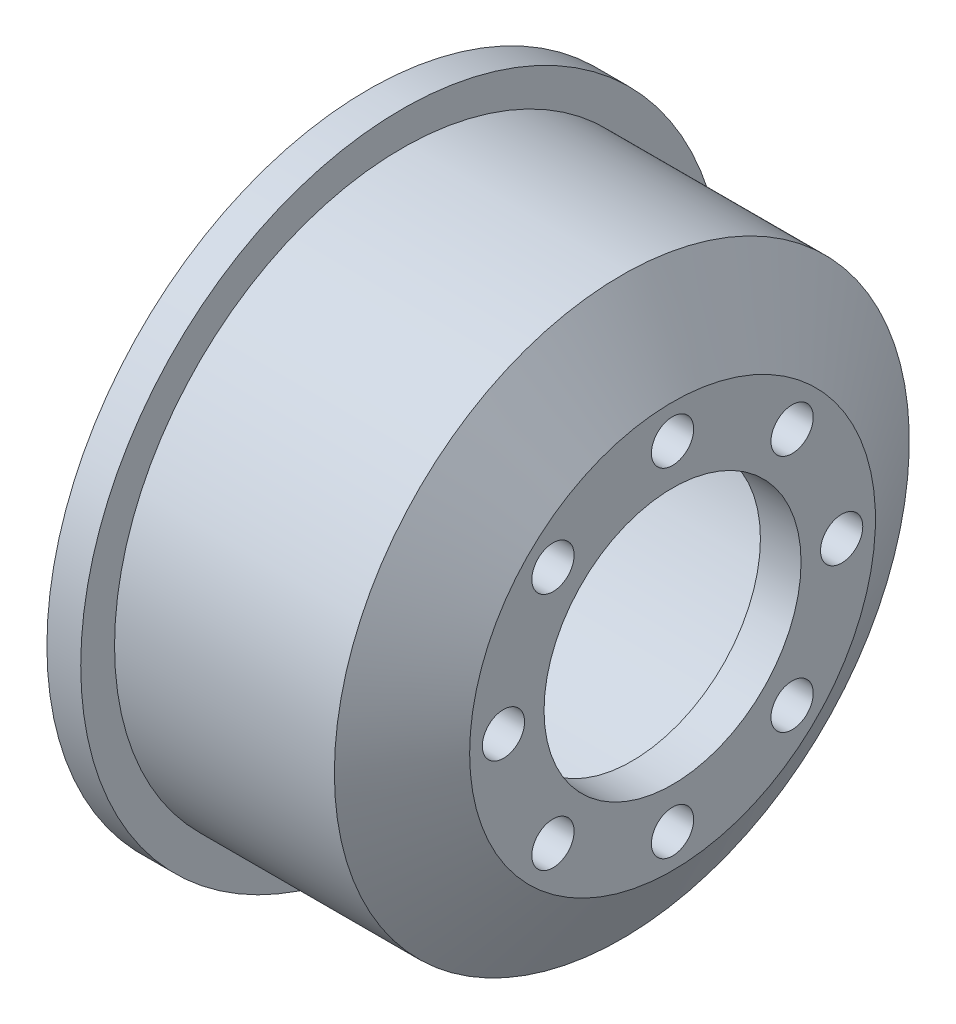
ISO-10303-21;
HEADER;
FILE_DESCRIPTION(('STEP AP214'),'2;1');
FILE_NAME('part.step','',(''),(''),'','','');
FILE_SCHEMA(('AUTOMOTIVE_DESIGN { 1 0 10303 214 1 1 1 1 }'));
ENDSEC;
DATA;
#1=APPLICATION_CONTEXT('core data for automotive mechanical design processes');
#2=APPLICATION_PROTOCOL_DEFINITION('international standard','automotive_design',2000,#1);
#3=PRODUCT_CONTEXT('',#1,'mechanical');
#4=PRODUCT('Part','Part','',(#3));
#5=PRODUCT_RELATED_PRODUCT_CATEGORY('part','',(#4));
#6=PRODUCT_DEFINITION_FORMATION('','',#4);
#7=PRODUCT_DEFINITION_CONTEXT('part definition',#1,'design');
#8=PRODUCT_DEFINITION('design','',#6,#7);
#9=PRODUCT_DEFINITION_SHAPE('','',#8);
#10=(LENGTH_UNIT() NAMED_UNIT(*) SI_UNIT(.MILLI.,.METRE.));
#11=(NAMED_UNIT(*) PLANE_ANGLE_UNIT() SI_UNIT($,.RADIAN.));
#12=(NAMED_UNIT(*) SI_UNIT($,.STERADIAN.) SOLID_ANGLE_UNIT());
#13=UNCERTAINTY_MEASURE_WITH_UNIT(LENGTH_MEASURE(1.E-05),#10,'distance_accuracy_value','');
#14=(GEOMETRIC_REPRESENTATION_CONTEXT(3) GLOBAL_UNCERTAINTY_ASSIGNED_CONTEXT((#13)) GLOBAL_UNIT_ASSIGNED_CONTEXT((#10,
#11,#12)) REPRESENTATION_CONTEXT('',''));
#15=CARTESIAN_POINT('',(0.,0.,0.));
#16=DIRECTION('',(0.,0.,1.));
#17=DIRECTION('',(1.,0.,0.));
#18=AXIS2_PLACEMENT_3D('',#15,#16,#17);
#19=CARTESIAN_POINT('',(-37.2788661687838,0.,0.));
#20=DIRECTION('',(-1.,0.,0.));
#21=DIRECTION('',(0.,0.,1.));
#22=AXIS2_PLACEMENT_3D('',#19,#20,#21);
#23=CYLINDRICAL_SURFACE('',#22,7.6);
#24=CARTESIAN_POINT('',(10.1398131593203,0.,0.));
#25=DIRECTION('',(-1.,0.,0.));
#26=DIRECTION('',(0.,0.,1.));
#27=AXIS2_PLACEMENT_3D('',#24,#25,#26);
#28=CIRCLE('',#27,7.6);
#29=CARTESIAN_POINT('',(10.1398131593203,0.,7.6));
#30=VERTEX_POINT('',#29);
#31=EDGE_CURVE('E10',#30,#30,#28,.T.);
#32=ORIENTED_EDGE('',*,*,#31,.F.);
#33=EDGE_LOOP('',(#32));
#34=FACE_BOUND('',#33,.T.);
#35=CARTESIAN_POINT('',(7.73636722696176,0.,0.));
#36=DIRECTION('',(-1.,0.,0.));
#37=DIRECTION('',(0.,0.,1.));
#38=AXIS2_PLACEMENT_3D('',#35,#36,#37);
#39=CIRCLE('',#38,7.6);
#40=CARTESIAN_POINT('',(7.73636722696176,0.,7.6));
#41=VERTEX_POINT('',#40);
#42=EDGE_CURVE('E76',#41,#41,#39,.T.);
#43=ORIENTED_EDGE('',*,*,#42,.T.);
#44=EDGE_LOOP('',(#43));
#45=FACE_BOUND('',#44,.T.);
#46=ADVANCED_FACE('F37',(#34,#45),#23,.F.);
#47=CARTESIAN_POINT('',(10.1398131593203,0.,-7.6));
#48=DIRECTION('',(-1.,0.,0.));
#49=DIRECTION('',(0.,0.,1.));
#50=AXIS2_PLACEMENT_3D('',#47,#48,#49);
#51=PLANE('',#50);
#52=CARTESIAN_POINT('',(10.1398131593203,10.,0.));
#53=DIRECTION('',(1.,0.,0.));
#54=DIRECTION('',(0.,0.,-1.));
#55=AXIS2_PLACEMENT_3D('',#52,#53,#54);
#56=CIRCLE('',#55,1.25);
#57=CARTESIAN_POINT('',(10.1398131593203,10.,-1.25));
#58=VERTEX_POINT('',#57);
#59=EDGE_CURVE('E57',#58,#58,#56,.T.);
#60=ORIENTED_EDGE('',*,*,#59,.F.);
#61=EDGE_LOOP('',(#60));
#62=FACE_BOUND('',#61,.T.);
#63=CARTESIAN_POINT('',(10.1398131593203,7.07106781186578,-7.0710678118656));
#64=DIRECTION('',(1.,0.,0.));
#65=DIRECTION('',(0.,0.,-1.));
#66=AXIS2_PLACEMENT_3D('',#63,#64,#65);
#67=CIRCLE('',#66,1.25000000000005);
#68=CARTESIAN_POINT('',(10.1398131593203,7.07106781186578,-8.32106781186565));
#69=VERTEX_POINT('',#68);
#70=EDGE_CURVE('E200',#69,#69,#67,.T.);
#71=ORIENTED_EDGE('',*,*,#70,.F.);
#72=EDGE_LOOP('',(#71));
#73=FACE_BOUND('',#72,.T.);
#74=CARTESIAN_POINT('',(10.1398131593203,4.24488671257339E-13,-10.0000000000004));
#75=DIRECTION('',(1.,0.,0.));
#76=DIRECTION('',(0.,0.,-1.));
#77=AXIS2_PLACEMENT_3D('',#74,#75,#76);
#78=CIRCLE('',#77,1.25000000000032);
#79=CARTESIAN_POINT('',(10.1398131593203,4.24488671257339E-13,-11.2500000000007));
#80=VERTEX_POINT('',#79);
#81=EDGE_CURVE('E203',#80,#80,#78,.T.);
#82=ORIENTED_EDGE('',*,*,#81,.F.);
#83=EDGE_LOOP('',(#82));
#84=FACE_BOUND('',#83,.T.);
#85=CARTESIAN_POINT('',(10.1398131593203,-7.07106781186517,-7.0710678118662));
#86=DIRECTION('',(1.,0.,0.));
#87=DIRECTION('',(0.,0.,-1.));
#88=AXIS2_PLACEMENT_3D('',#85,#86,#87);
#89=CIRCLE('',#88,1.25000000000066);
#90=CARTESIAN_POINT('',(10.1398131593203,-7.07106781186517,-8.32106781186686));
#91=VERTEX_POINT('',#90);
#92=EDGE_CURVE('E208',#91,#91,#89,.T.);
#93=ORIENTED_EDGE('',*,*,#92,.F.);
#94=EDGE_LOOP('',(#93));
#95=FACE_BOUND('',#94,.T.);
#96=CARTESIAN_POINT('',(10.1398131593203,-10.,-8.48977342514678E-13));
#97=DIRECTION('',(1.,0.,0.));
#98=DIRECTION('',(0.,0.,-1.));
#99=AXIS2_PLACEMENT_3D('',#96,#97,#98);
#100=CIRCLE('',#99,1.25000000000088);
#101=CARTESIAN_POINT('',(10.1398131593203,-10.,-1.25000000000173));
#102=VERTEX_POINT('',#101);
#103=EDGE_CURVE('E211',#102,#102,#100,.T.);
#104=ORIENTED_EDGE('',*,*,#103,.F.);
#105=EDGE_LOOP('',(#104));
#106=FACE_BOUND('',#105,.T.);
#107=CARTESIAN_POINT('',(10.1398131593203,-7.07106781186578,7.07106781186475));
#108=DIRECTION('',(1.,0.,0.));
#109=DIRECTION('',(0.,0.,-1.));
#110=AXIS2_PLACEMENT_3D('',#107,#108,#109);
#111=CIRCLE('',#110,1.25000000000086);
#112=CARTESIAN_POINT('',(10.1398131593203,-7.07106781186578,5.82106781186389));
#113=VERTEX_POINT('',#112);
#114=EDGE_CURVE('E214',#113,#113,#111,.T.);
#115=ORIENTED_EDGE('',*,*,#114,.F.);
#116=EDGE_LOOP('',(#115));
#117=FACE_BOUND('',#116,.T.);
#118=CARTESIAN_POINT('',(10.1398131593203,-4.25713318056486E-13,9.99999999999958));
#119=DIRECTION('',(1.,0.,0.));
#120=DIRECTION('',(0.,0.,-1.));
#121=AXIS2_PLACEMENT_3D('',#118,#119,#120);
#122=CIRCLE('',#121,1.25000000000063);
#123=CARTESIAN_POINT('',(10.1398131593203,-4.25713318056486E-13,8.74999999999895));
#124=VERTEX_POINT('',#123);
#125=EDGE_CURVE('E216',#124,#124,#122,.T.);
#126=ORIENTED_EDGE('',*,*,#125,.F.);
#127=EDGE_LOOP('',(#126));
#128=FACE_BOUND('',#127,.T.);
#129=CARTESIAN_POINT('',(10.1398131593203,7.07106781186517,7.07106781186535));
#130=DIRECTION('',(1.,0.,0.));
#131=DIRECTION('',(0.,0.,-1.));
#132=AXIS2_PLACEMENT_3D('',#129,#130,#131);
#133=CIRCLE('',#132,1.25000000000032);
#134=CARTESIAN_POINT('',(10.1398131593203,7.07106781186517,5.82106781186503));
#135=VERTEX_POINT('',#134);
#136=EDGE_CURVE('E88',#135,#135,#133,.T.);
#137=ORIENTED_EDGE('',*,*,#136,.F.);
#138=EDGE_LOOP('',(#137));
#139=FACE_BOUND('',#138,.T.);
#140=CARTESIAN_POINT('',(10.1398131593203,0.,0.));
#141=DIRECTION('',(-1.,0.,0.));
#142=DIRECTION('',(0.,0.,1.));
#143=AXIS2_PLACEMENT_3D('',#140,#141,#142);
#144=CIRCLE('',#143,12.);
#145=CARTESIAN_POINT('',(10.1398131593203,0.,12.));
#146=VERTEX_POINT('',#145);
#147=EDGE_CURVE('E44',#146,#146,#144,.T.);
#148=ORIENTED_EDGE('',*,*,#147,.F.);
#149=EDGE_LOOP('',(#148));
#150=FACE_BOUND('',#149,.T.);
#151=ORIENTED_EDGE('',*,*,#31,.T.);
#152=EDGE_LOOP('',(#151));
#153=FACE_BOUND('',#152,.T.);
#154=ADVANCED_FACE('F118',(#62,#73,#84,#95,#106,#117,#128,#139,#150,#153),#51,.F.);
#155=CARTESIAN_POINT('',(10.1398131593203,0.,0.));
#156=DIRECTION('',(-1.,0.,0.));
#157=DIRECTION('',(0.,0.,1.));
#158=AXIS2_PLACEMENT_3D('',#155,#156,#157);
#159=CONICAL_SURFACE('',#158,12.,1.03037682652431);
#160=CARTESIAN_POINT('',(7.13981315932029,0.,0.));
#161=DIRECTION('',(-1.,0.,0.));
#162=DIRECTION('',(0.,0.,1.));
#163=AXIS2_PLACEMENT_3D('',#160,#161,#162);
#164=CIRCLE('',#163,17.);
#165=CARTESIAN_POINT('',(7.13981315932029,0.,17.));
#166=VERTEX_POINT('',#165);
#167=EDGE_CURVE('E49',#166,#166,#164,.T.);
#168=ORIENTED_EDGE('',*,*,#167,.F.);
#169=EDGE_LOOP('',(#168));
#170=FACE_BOUND('',#169,.T.);
#171=ORIENTED_EDGE('',*,*,#147,.T.);
#172=EDGE_LOOP('',(#171));
#173=FACE_BOUND('',#172,.T.);
#174=ADVANCED_FACE('F115',(#170,#173),#159,.T.);
#175=CARTESIAN_POINT('',(-37.2788661687838,0.,0.));
#176=DIRECTION('',(-1.,0.,0.));
#177=DIRECTION('',(0.,0.,1.));
#178=AXIS2_PLACEMENT_3D('',#175,#176,#177);
#179=CYLINDRICAL_SURFACE('',#178,17.);
#180=CARTESIAN_POINT('',(-5.86018684067971,0.,0.));
#181=DIRECTION('',(-1.,0.,0.));
#182=DIRECTION('',(0.,0.,1.));
#183=AXIS2_PLACEMENT_3D('',#180,#181,#182);
#184=CIRCLE('',#183,17.);
#185=CARTESIAN_POINT('',(-5.86018684067971,0.,17.));
#186=VERTEX_POINT('',#185);
#187=EDGE_CURVE('E108',#186,#186,#184,.T.);
#188=ORIENTED_EDGE('',*,*,#187,.F.);
#189=EDGE_LOOP('',(#188));
#190=FACE_BOUND('',#189,.T.);
#191=ORIENTED_EDGE('',*,*,#167,.T.);
#192=EDGE_LOOP('',(#191));
#193=FACE_BOUND('',#192,.T.);
#194=ADVANCED_FACE('F113',(#190,#193),#179,.T.);
#195=CARTESIAN_POINT('',(-5.86018684067971,0.,-19.));
#196=DIRECTION('',(-1.,0.,0.));
#197=DIRECTION('',(0.,0.,1.));
#198=AXIS2_PLACEMENT_3D('',#195,#196,#197);
#199=PLANE('',#198);
#200=CARTESIAN_POINT('',(-5.86018684067971,0.,0.));
#201=DIRECTION('',(-1.,0.,0.));
#202=DIRECTION('',(0.,0.,1.));
#203=AXIS2_PLACEMENT_3D('',#200,#201,#202);
#204=CIRCLE('',#203,19.);
#205=CARTESIAN_POINT('',(-5.86018684067971,0.,19.));
#206=VERTEX_POINT('',#205);
#207=EDGE_CURVE('E105',#206,#206,#204,.T.);
#208=ORIENTED_EDGE('',*,*,#207,.F.);
#209=EDGE_LOOP('',(#208));
#210=FACE_BOUND('',#209,.T.);
#211=ORIENTED_EDGE('',*,*,#187,.T.);
#212=EDGE_LOOP('',(#211));
#213=FACE_BOUND('',#212,.T.);
#214=ADVANCED_FACE('F133',(#210,#213),#199,.F.);
#215=CARTESIAN_POINT('',(-37.2788661687838,0.,0.));
#216=DIRECTION('',(-1.,0.,0.));
#217=DIRECTION('',(0.,0.,1.));
#218=AXIS2_PLACEMENT_3D('',#215,#216,#217);
#219=CYLINDRICAL_SURFACE('',#218,19.);
#220=CARTESIAN_POINT('',(-7.86018684067971,0.,0.));
#221=DIRECTION('',(-1.,0.,0.));
#222=DIRECTION('',(0.,0.,1.));
#223=AXIS2_PLACEMENT_3D('',#220,#221,#222);
#224=CIRCLE('',#223,19.);
#225=CARTESIAN_POINT('',(-7.86018684067971,0.,19.));
#226=VERTEX_POINT('',#225);
#227=EDGE_CURVE('E102',#226,#226,#224,.T.);
#228=ORIENTED_EDGE('',*,*,#227,.F.);
#229=EDGE_LOOP('',(#228));
#230=FACE_BOUND('',#229,.T.);
#231=ORIENTED_EDGE('',*,*,#207,.T.);
#232=EDGE_LOOP('',(#231));
#233=FACE_BOUND('',#232,.T.);
#234=ADVANCED_FACE('F137',(#230,#233),#219,.T.);
#235=CARTESIAN_POINT('',(-7.86018684067971,0.,-19.));
#236=DIRECTION('',(1.,0.,0.));
#237=DIRECTION('',(0.,0.,-1.));
#238=AXIS2_PLACEMENT_3D('',#235,#236,#237);
#239=PLANE('',#238);
#240=CARTESIAN_POINT('',(-7.8601868406797,0.,0.));
#241=DIRECTION('',(-1.,0.,0.));
#242=DIRECTION('',(0.,0.,1.));
#243=AXIS2_PLACEMENT_3D('',#240,#241,#242);
#244=CIRCLE('',#243,18.);
#245=CARTESIAN_POINT('',(-7.8601868406797,0.,18.));
#246=VERTEX_POINT('',#245);
#247=EDGE_CURVE('E99',#246,#246,#244,.T.);
#248=ORIENTED_EDGE('',*,*,#247,.F.);
#249=EDGE_LOOP('',(#248));
#250=FACE_BOUND('',#249,.T.);
#251=ORIENTED_EDGE('',*,*,#227,.T.);
#252=EDGE_LOOP('',(#251));
#253=FACE_BOUND('',#252,.T.);
#254=ADVANCED_FACE('F141',(#250,#253),#239,.F.);
#255=CARTESIAN_POINT('',(-37.2788661687838,0.,0.));
#256=DIRECTION('',(-1.,0.,0.));
#257=DIRECTION('',(0.,0.,1.));
#258=AXIS2_PLACEMENT_3D('',#255,#256,#257);
#259=CYLINDRICAL_SURFACE('',#258,18.);
#260=CARTESIAN_POINT('',(-7.36018684067971,0.,0.));
#261=DIRECTION('',(-1.,0.,0.));
#262=DIRECTION('',(0.,0.,1.));
#263=AXIS2_PLACEMENT_3D('',#260,#261,#262);
#264=CIRCLE('',#263,18.);
#265=CARTESIAN_POINT('',(-7.36018684067971,0.,18.));
#266=VERTEX_POINT('',#265);
#267=EDGE_CURVE('E96',#266,#266,#264,.T.);
#268=ORIENTED_EDGE('',*,*,#267,.F.);
#269=EDGE_LOOP('',(#268));
#270=FACE_BOUND('',#269,.T.);
#271=ORIENTED_EDGE('',*,*,#247,.T.);
#272=EDGE_LOOP('',(#271));
#273=FACE_BOUND('',#272,.T.);
#274=ADVANCED_FACE('F145',(#270,#273),#259,.F.);
#275=CARTESIAN_POINT('',(-7.36018684067971,0.,-14.55));
#276=DIRECTION('',(1.,0.,0.));
#277=DIRECTION('',(0.,0.,-1.));
#278=AXIS2_PLACEMENT_3D('',#275,#276,#277);
#279=PLANE('',#278);
#280=CARTESIAN_POINT('',(-7.36018684067971,0.,0.));
#281=DIRECTION('',(-1.,0.,0.));
#282=DIRECTION('',(0.,0.,1.));
#283=AXIS2_PLACEMENT_3D('',#280,#281,#282);
#284=CIRCLE('',#283,14.55);
#285=CARTESIAN_POINT('',(-7.36018684067971,0.,14.55));
#286=VERTEX_POINT('',#285);
#287=EDGE_CURVE('E93',#286,#286,#284,.T.);
#288=ORIENTED_EDGE('',*,*,#287,.F.);
#289=EDGE_LOOP('',(#288));
#290=FACE_BOUND('',#289,.T.);
#291=ORIENTED_EDGE('',*,*,#267,.T.);
#292=EDGE_LOOP('',(#291));
#293=FACE_BOUND('',#292,.T.);
#294=ADVANCED_FACE('F149',(#290,#293),#279,.F.);
#295=CARTESIAN_POINT('',(-37.2788661687838,0.,0.));
#296=DIRECTION('',(-1.,0.,0.));
#297=DIRECTION('',(0.,0.,1.));
#298=AXIS2_PLACEMENT_3D('',#295,#296,#297);
#299=CYLINDRICAL_SURFACE('',#298,14.55);
#300=CARTESIAN_POINT('',(6.08993501534973,0.,0.));
#301=DIRECTION('',(-1.,0.,0.));
#302=DIRECTION('',(0.,0.,1.));
#303=AXIS2_PLACEMENT_3D('',#300,#301,#302);
#304=CIRCLE('',#303,14.55);
#305=CARTESIAN_POINT('',(6.08993501534973,0.,14.55));
#306=VERTEX_POINT('',#305);
#307=EDGE_CURVE('E85',#306,#306,#304,.T.);
#308=ORIENTED_EDGE('',*,*,#307,.F.);
#309=EDGE_LOOP('',(#308));
#310=FACE_BOUND('',#309,.T.);
#311=ORIENTED_EDGE('',*,*,#287,.T.);
#312=EDGE_LOOP('',(#311));
#313=FACE_BOUND('',#312,.T.);
#314=ADVANCED_FACE('F153',(#310,#313),#299,.F.);
#315=CARTESIAN_POINT('',(6.08993501534973,0.,0.));
#316=DIRECTION('',(-1.,0.,0.));
#317=DIRECTION('',(0.,0.,1.));
#318=AXIS2_PLACEMENT_3D('',#315,#316,#317);
#319=CONICAL_SURFACE('',#318,14.55,1.03037682652431);
#320=CARTESIAN_POINT('',(7.73636722696176,0.,0.));
#321=DIRECTION('',(-1.,0.,0.));
#322=DIRECTION('',(0.,0.,1.));
#323=AXIS2_PLACEMENT_3D('',#320,#321,#322);
#324=CIRCLE('',#323,11.80594631398);
#325=CARTESIAN_POINT('',(7.73636722696176,0.,11.80594631398));
#326=VERTEX_POINT('',#325);
#327=EDGE_CURVE('E80',#326,#326,#324,.T.);
#328=ORIENTED_EDGE('',*,*,#327,.F.);
#329=EDGE_LOOP('',(#328));
#330=FACE_BOUND('',#329,.T.);
#331=ORIENTED_EDGE('',*,*,#307,.T.);
#332=EDGE_LOOP('',(#331));
#333=FACE_BOUND('',#332,.T.);
#334=ADVANCED_FACE('F157',(#330,#333),#319,.F.);
#335=CARTESIAN_POINT('',(7.73636722696176,0.,-11.80594631398));
#336=DIRECTION('',(1.,0.,0.));
#337=DIRECTION('',(0.,0.,-1.));
#338=AXIS2_PLACEMENT_3D('',#335,#336,#337);
#339=PLANE('',#338);
#340=CARTESIAN_POINT('',(7.73636722696176,10.,0.));
#341=DIRECTION('',(1.,0.,0.));
#342=DIRECTION('',(0.,0.,-1.));
#343=AXIS2_PLACEMENT_3D('',#340,#341,#342);
#344=CIRCLE('',#343,1.25);
#345=CARTESIAN_POINT('',(7.73636722696176,10.,-1.25));
#346=VERTEX_POINT('',#345);
#347=EDGE_CURVE('E40',#346,#346,#344,.T.);
#348=ORIENTED_EDGE('',*,*,#347,.T.);
#349=EDGE_LOOP('',(#348));
#350=FACE_BOUND('',#349,.T.);
#351=CARTESIAN_POINT('',(7.73636722696176,7.07106781186578,-7.0710678118656));
#352=DIRECTION('',(1.,0.,0.));
#353=DIRECTION('',(0.,0.,-1.));
#354=AXIS2_PLACEMENT_3D('',#351,#352,#353);
#355=CIRCLE('',#354,1.25000000000005);
#356=CARTESIAN_POINT('',(7.73636722696176,7.07106781186578,-8.32106781186565));
#357=VERTEX_POINT('',#356);
#358=EDGE_CURVE('E71',#357,#357,#355,.T.);
#359=ORIENTED_EDGE('',*,*,#358,.T.);
#360=EDGE_LOOP('',(#359));
#361=FACE_BOUND('',#360,.T.);
#362=CARTESIAN_POINT('',(7.73636722696176,4.24488671257339E-13,-10.0000000000004));
#363=DIRECTION('',(1.,0.,0.));
#364=DIRECTION('',(0.,0.,-1.));
#365=AXIS2_PLACEMENT_3D('',#362,#363,#364);
#366=CIRCLE('',#365,1.25000000000032);
#367=CARTESIAN_POINT('',(7.73636722696176,4.24488671257339E-13,-11.2500000000007));
#368=VERTEX_POINT('',#367);
#369=EDGE_CURVE('E69',#368,#368,#366,.T.);
#370=ORIENTED_EDGE('',*,*,#369,.T.);
#371=EDGE_LOOP('',(#370));
#372=FACE_BOUND('',#371,.T.);
#373=CARTESIAN_POINT('',(7.73636722696176,-7.07106781186517,-7.0710678118662));
#374=DIRECTION('',(1.,0.,0.));
#375=DIRECTION('',(0.,0.,-1.));
#376=AXIS2_PLACEMENT_3D('',#373,#374,#375);
#377=CIRCLE('',#376,1.25000000000066);
#378=CARTESIAN_POINT('',(7.73636722696176,-7.07106781186517,-8.32106781186686));
#379=VERTEX_POINT('',#378);
#380=EDGE_CURVE('E66',#379,#379,#377,.T.);
#381=ORIENTED_EDGE('',*,*,#380,.T.);
#382=EDGE_LOOP('',(#381));
#383=FACE_BOUND('',#382,.T.);
#384=CARTESIAN_POINT('',(7.73636722696176,-10.,-8.48977342514678E-13));
#385=DIRECTION('',(1.,0.,0.));
#386=DIRECTION('',(0.,0.,-1.));
#387=AXIS2_PLACEMENT_3D('',#384,#385,#386);
#388=CIRCLE('',#387,1.25000000000088);
#389=CARTESIAN_POINT('',(7.73636722696176,-10.,-1.25000000000173));
#390=VERTEX_POINT('',#389);
#391=EDGE_CURVE('E63',#390,#390,#388,.T.);
#392=ORIENTED_EDGE('',*,*,#391,.T.);
#393=EDGE_LOOP('',(#392));
#394=FACE_BOUND('',#393,.T.);
#395=CARTESIAN_POINT('',(7.73636722696176,-7.07106781186578,7.07106781186475));
#396=DIRECTION('',(1.,0.,0.));
#397=DIRECTION('',(0.,0.,-1.));
#398=AXIS2_PLACEMENT_3D('',#395,#396,#397);
#399=CIRCLE('',#398,1.25000000000086);
#400=CARTESIAN_POINT('',(7.73636722696176,-7.07106781186578,5.82106781186389));
#401=VERTEX_POINT('',#400);
#402=EDGE_CURVE('E60',#401,#401,#399,.T.);
#403=ORIENTED_EDGE('',*,*,#402,.T.);
#404=EDGE_LOOP('',(#403));
#405=FACE_BOUND('',#404,.T.);
#406=CARTESIAN_POINT('',(7.73636722696176,-4.25713318056486E-13,9.99999999999958));
#407=DIRECTION('',(1.,0.,0.));
#408=DIRECTION('',(0.,0.,-1.));
#409=AXIS2_PLACEMENT_3D('',#406,#407,#408);
#410=CIRCLE('',#409,1.25000000000063);
#411=CARTESIAN_POINT('',(7.73636722696176,-4.25713318056486E-13,8.74999999999895));
#412=VERTEX_POINT('',#411);
#413=EDGE_CURVE('E56',#412,#412,#410,.T.);
#414=ORIENTED_EDGE('',*,*,#413,.T.);
#415=EDGE_LOOP('',(#414));
#416=FACE_BOUND('',#415,.T.);
#417=CARTESIAN_POINT('',(7.73636722696176,7.07106781186517,7.07106781186535));
#418=DIRECTION('',(1.,0.,0.));
#419=DIRECTION('',(0.,0.,-1.));
#420=AXIS2_PLACEMENT_3D('',#417,#418,#419);
#421=CIRCLE('',#420,1.25000000000032);
#422=CARTESIAN_POINT('',(7.73636722696176,7.07106781186517,5.82106781186503));
#423=VERTEX_POINT('',#422);
#424=EDGE_CURVE('E53',#423,#423,#421,.T.);
#425=ORIENTED_EDGE('',*,*,#424,.T.);
#426=EDGE_LOOP('',(#425));
#427=FACE_BOUND('',#426,.T.);
#428=ORIENTED_EDGE('',*,*,#42,.F.);
#429=EDGE_LOOP('',(#428));
#430=FACE_BOUND('',#429,.T.);
#431=ORIENTED_EDGE('',*,*,#327,.T.);
#432=EDGE_LOOP('',(#431));
#433=FACE_BOUND('',#432,.T.);
#434=ADVANCED_FACE('F161',(#350,#361,#372,#383,#394,#405,#416,#427,#430,#433),#339,.F.);
#435=CARTESIAN_POINT('',(-7.86018684067971,7.07106781186517,7.07106781186535));
#436=DIRECTION('',(1.,0.,0.));
#437=DIRECTION('',(0.,0.,-1.));
#438=AXIS2_PLACEMENT_3D('',#435,#436,#437);
#439=CYLINDRICAL_SURFACE('',#438,1.25000000000032);
#440=ORIENTED_EDGE('',*,*,#136,.T.);
#441=EDGE_LOOP('',(#440));
#442=FACE_BOUND('',#441,.T.);
#443=ORIENTED_EDGE('',*,*,#424,.F.);
#444=EDGE_LOOP('',(#443));
#445=FACE_BOUND('',#444,.T.);
#446=ADVANCED_FACE('F165',(#442,#445),#439,.F.);
#447=CARTESIAN_POINT('',(-7.86018684067971,-4.25713318056486E-13,9.99999999999958));
#448=DIRECTION('',(1.,0.,0.));
#449=DIRECTION('',(0.,0.,-1.));
#450=AXIS2_PLACEMENT_3D('',#447,#448,#449);
#451=CYLINDRICAL_SURFACE('',#450,1.25000000000063);
#452=ORIENTED_EDGE('',*,*,#125,.T.);
#453=EDGE_LOOP('',(#452));
#454=FACE_BOUND('',#453,.T.);
#455=ORIENTED_EDGE('',*,*,#413,.F.);
#456=EDGE_LOOP('',(#455));
#457=FACE_BOUND('',#456,.T.);
#458=ADVANCED_FACE('F168',(#454,#457),#451,.F.);
#459=CARTESIAN_POINT('',(-7.86018684067971,-7.07106781186578,7.07106781186475));
#460=DIRECTION('',(1.,0.,0.));
#461=DIRECTION('',(0.,0.,-1.));
#462=AXIS2_PLACEMENT_3D('',#459,#460,#461);
#463=CYLINDRICAL_SURFACE('',#462,1.25000000000086);
#464=ORIENTED_EDGE('',*,*,#114,.T.);
#465=EDGE_LOOP('',(#464));
#466=FACE_BOUND('',#465,.T.);
#467=ORIENTED_EDGE('',*,*,#402,.F.);
#468=EDGE_LOOP('',(#467));
#469=FACE_BOUND('',#468,.T.);
#470=ADVANCED_FACE('F172',(#466,#469),#463,.F.);
#471=CARTESIAN_POINT('',(-7.86018684067971,-10.,-8.48977342514678E-13));
#472=DIRECTION('',(1.,0.,0.));
#473=DIRECTION('',(0.,0.,-1.));
#474=AXIS2_PLACEMENT_3D('',#471,#472,#473);
#475=CYLINDRICAL_SURFACE('',#474,1.25000000000088);
#476=ORIENTED_EDGE('',*,*,#103,.T.);
#477=EDGE_LOOP('',(#476));
#478=FACE_BOUND('',#477,.T.);
#479=ORIENTED_EDGE('',*,*,#391,.F.);
#480=EDGE_LOOP('',(#479));
#481=FACE_BOUND('',#480,.T.);
#482=ADVANCED_FACE('F176',(#478,#481),#475,.F.);
#483=CARTESIAN_POINT('',(-7.86018684067971,-7.07106781186517,-7.0710678118662));
#484=DIRECTION('',(1.,0.,0.));
#485=DIRECTION('',(0.,0.,-1.));
#486=AXIS2_PLACEMENT_3D('',#483,#484,#485);
#487=CYLINDRICAL_SURFACE('',#486,1.25000000000066);
#488=ORIENTED_EDGE('',*,*,#92,.T.);
#489=EDGE_LOOP('',(#488));
#490=FACE_BOUND('',#489,.T.);
#491=ORIENTED_EDGE('',*,*,#380,.F.);
#492=EDGE_LOOP('',(#491));
#493=FACE_BOUND('',#492,.T.);
#494=ADVANCED_FACE('F180',(#490,#493),#487,.F.);
#495=CARTESIAN_POINT('',(-7.86018684067971,4.24488671257339E-13,-10.0000000000004));
#496=DIRECTION('',(1.,0.,0.));
#497=DIRECTION('',(0.,0.,-1.));
#498=AXIS2_PLACEMENT_3D('',#495,#496,#497);
#499=CYLINDRICAL_SURFACE('',#498,1.25000000000032);
#500=ORIENTED_EDGE('',*,*,#81,.T.);
#501=EDGE_LOOP('',(#500));
#502=FACE_BOUND('',#501,.T.);
#503=ORIENTED_EDGE('',*,*,#369,.F.);
#504=EDGE_LOOP('',(#503));
#505=FACE_BOUND('',#504,.T.);
#506=ADVANCED_FACE('F184',(#502,#505),#499,.F.);
#507=CARTESIAN_POINT('',(-7.86018684067971,7.07106781186578,-7.0710678118656));
#508=DIRECTION('',(1.,0.,0.));
#509=DIRECTION('',(0.,0.,-1.));
#510=AXIS2_PLACEMENT_3D('',#507,#508,#509);
#511=CYLINDRICAL_SURFACE('',#510,1.25000000000005);
#512=ORIENTED_EDGE('',*,*,#70,.T.);
#513=EDGE_LOOP('',(#512));
#514=FACE_BOUND('',#513,.T.);
#515=ORIENTED_EDGE('',*,*,#358,.F.);
#516=EDGE_LOOP('',(#515));
#517=FACE_BOUND('',#516,.T.);
#518=ADVANCED_FACE('F188',(#514,#517),#511,.F.);
#519=CARTESIAN_POINT('',(-7.86018684067971,10.,0.));
#520=DIRECTION('',(1.,0.,0.));
#521=DIRECTION('',(0.,0.,-1.));
#522=AXIS2_PLACEMENT_3D('',#519,#520,#521);
#523=CYLINDRICAL_SURFACE('',#522,1.25);
#524=ORIENTED_EDGE('',*,*,#59,.T.);
#525=EDGE_LOOP('',(#524));
#526=FACE_BOUND('',#525,.T.);
#527=ORIENTED_EDGE('',*,*,#347,.F.);
#528=EDGE_LOOP('',(#527));
#529=FACE_BOUND('',#528,.T.);
#530=ADVANCED_FACE('F192',(#526,#529),#523,.F.);
#531=CLOSED_SHELL('',(#46,#154,#174,#194,#214,#234,#254,#274,#294,#314,#334,#434,#446,#458,#470,
#482,#494,#506,#518,#530));
#532=MANIFOLD_SOLID_BREP('B2',#531);
#533=ADVANCED_BREP_SHAPE_REPRESENTATION('',(#18,#532),#14);
#534=SHAPE_DEFINITION_REPRESENTATION(#9,#533);
ENDSEC;
END-ISO-10303-21;
